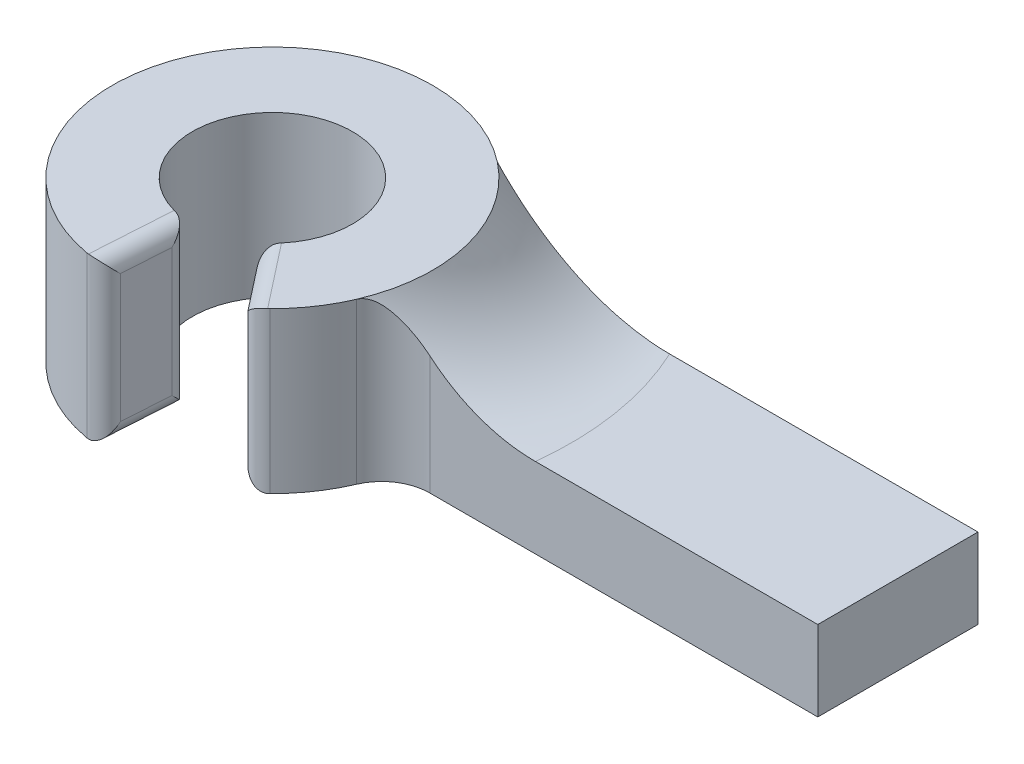
ISO-10303-21;
HEADER;
FILE_DESCRIPTION(('STEP AP214'),'2;1');
FILE_NAME('part.step','',(''),(''),'','','');
FILE_SCHEMA(('AUTOMOTIVE_DESIGN { 1 0 10303 214 1 1 1 1 }'));
ENDSEC;
DATA;
#1=APPLICATION_CONTEXT('core data for automotive mechanical design processes');
#2=APPLICATION_PROTOCOL_DEFINITION('international standard','automotive_design',2000,#1);
#3=PRODUCT_CONTEXT('',#1,'mechanical');
#4=PRODUCT('Part','Part','',(#3));
#5=PRODUCT_RELATED_PRODUCT_CATEGORY('part','',(#4));
#6=PRODUCT_DEFINITION_FORMATION('','',#4);
#7=PRODUCT_DEFINITION_CONTEXT('part definition',#1,'design');
#8=PRODUCT_DEFINITION('design','',#6,#7);
#9=PRODUCT_DEFINITION_SHAPE('','',#8);
#10=(LENGTH_UNIT() NAMED_UNIT(*) SI_UNIT(.MILLI.,.METRE.));
#11=(NAMED_UNIT(*) PLANE_ANGLE_UNIT() SI_UNIT($,.RADIAN.));
#12=(NAMED_UNIT(*) SI_UNIT($,.STERADIAN.) SOLID_ANGLE_UNIT());
#13=UNCERTAINTY_MEASURE_WITH_UNIT(LENGTH_MEASURE(1.E-05),#10,'distance_accuracy_value','');
#14=(GEOMETRIC_REPRESENTATION_CONTEXT(3) GLOBAL_UNCERTAINTY_ASSIGNED_CONTEXT((#13)) GLOBAL_UNIT_ASSIGNED_CONTEXT((#10,
#11,#12)) REPRESENTATION_CONTEXT('',''));
#15=CARTESIAN_POINT('',(0.,0.,0.));
#16=DIRECTION('',(0.,0.,1.));
#17=DIRECTION('',(1.,0.,0.));
#18=AXIS2_PLACEMENT_3D('',#15,#16,#17);
#19=CARTESIAN_POINT('',(0.,10.,0.));
#20=DIRECTION('',(0.,-1.,0.));
#21=DIRECTION('',(0.,0.,-1.));
#22=AXIS2_PLACEMENT_3D('',#19,#20,#21);
#23=CYLINDRICAL_SURFACE('',#22,10.);
#24=CARTESIAN_POINT('',(0.,0.,0.));
#25=DIRECTION('',(0.,1.,0.));
#26=DIRECTION('',(0.,0.,1.));
#27=AXIS2_PLACEMENT_3D('',#24,#25,#26);
#28=CIRCLE('',#27,10.);
#29=CARTESIAN_POINT('',(6.16474964365289,0.,-7.87374509563788));
#30=VERTEX_POINT('',#29);
#31=CARTESIAN_POINT('',(-1.73311878005473,0.,9.84866992513312));
#32=VERTEX_POINT('',#31);
#33=EDGE_CURVE('E204',#30,#32,#28,.T.);
#34=ORIENTED_EDGE('',*,*,#33,.T.);
#35=DIRECTION('',(0.,-1.,0.));
#36=VECTOR('',#35,1.);
#37=CARTESIAN_POINT('',(-1.73311878005473,10.,9.84866992513312));
#38=LINE('',#37,#36);
#39=CARTESIAN_POINT('',(-1.73311878005473,10.,9.84866992513312));
#40=VERTEX_POINT('',#39);
#41=EDGE_CURVE('E11',#32,#40,#38,.F.);
#42=ORIENTED_EDGE('',*,*,#41,.T.);
#43=CARTESIAN_POINT('',(0.,10.,0.));
#44=DIRECTION('',(0.,1.,0.));
#45=DIRECTION('',(0.,0.,1.));
#46=AXIS2_PLACEMENT_3D('',#43,#44,#45);
#47=CIRCLE('',#46,10.);
#48=CARTESIAN_POINT('',(6.16474964365289,10.,-7.87374509563788));
#49=VERTEX_POINT('',#48);
#50=EDGE_CURVE('E197',#49,#40,#47,.T.);
#51=ORIENTED_EDGE('',*,*,#50,.F.);
#52=DIRECTION('',(0.,-1.,0.));
#53=VECTOR('',#52,1.);
#54=CARTESIAN_POINT('',(6.16474964365289,5.,-7.87374509563788));
#55=LINE('',#54,#53);
#56=EDGE_CURVE('E172',#49,#30,#55,.T.);
#57=ORIENTED_EDGE('',*,*,#56,.T.);
#58=EDGE_LOOP('',(#34,#42,#51,#57));
#59=FACE_BOUND('',#58,.T.);
#60=ADVANCED_FACE('F35',(#59),#23,.T.);
#61=CARTESIAN_POINT('',(0.,5.,2.12625490436212));
#62=DIRECTION('',(0.,0.,-1.));
#63=DIRECTION('',(-1.,0.,0.));
#64=AXIS2_PLACEMENT_3D('',#61,#62,#63);
#65=PLANE('',#64);
#66=CARTESIAN_POINT('',(18.5387195037458,5.,2.12625490436212));
#67=CARTESIAN_POINT('',(18.2522167080133,4.99996901371586,2.12625490436212));
#68=CARTESIAN_POINT('',(17.9657224089204,5.01215133792323,2.12625490436212));
#69=CARTESIAN_POINT('',(17.3948102929755,5.0606727920949,2.12625490436212));
#70=CARTESIAN_POINT('',(17.1103922996162,5.0970098439043,2.12625490436212));
#71=CARTESIAN_POINT('',(16.5461330199413,5.19348712011368,2.12625490436212));
#72=CARTESIAN_POINT('',(16.2662846389367,5.25358586818904,2.12625490436212));
#73=CARTESIAN_POINT('',(15.7126361320152,5.39710950841939,2.12625490436212));
#74=CARTESIAN_POINT('',(15.4388360042455,5.48053439342876,2.12625490436212));
#75=CARTESIAN_POINT('',(14.8991153732999,5.67011943541582,2.12625490436212));
#76=CARTESIAN_POINT('',(14.6331976936046,5.77628762961286,2.12625490436212));
#77=CARTESIAN_POINT('',(14.1110925760163,6.01061431386323,2.12625490436212));
#78=CARTESIAN_POINT('',(13.854909549509,6.13878263177138,2.12625490436212));
#79=CARTESIAN_POINT('',(13.3541542404636,6.41617880239697,2.12625490436212));
#80=CARTESIAN_POINT('',(13.1095838799614,6.56541012516974,2.12625490436212));
#81=CARTESIAN_POINT('',(12.6339260264047,6.88378704005655,2.12625490436212));
#82=CARTESIAN_POINT('',(12.4028328402101,7.05292413093678,2.12625490436212));
#83=CARTESIAN_POINT('',(11.9392737330681,7.42306713170316,2.12625490436212));
#84=CARTESIAN_POINT('',(11.707944515475,7.62549932854296,2.12625490436212));
#85=CARTESIAN_POINT('',(11.2644719178751,8.05040918843556,2.12625490436212));
#86=CARTESIAN_POINT('',(11.0523297602989,8.27288812689028,2.12625490436212));
#87=CARTESIAN_POINT('',(10.6485893343611,8.73666868927182,2.12625490436212));
#88=CARTESIAN_POINT('',(10.4570390247242,8.97801208551451,2.12625490436212));
#89=CARTESIAN_POINT('',(10.0966959447661,9.47715366776717,2.12625490436212));
#90=CARTESIAN_POINT('',(9.92790495144122,9.73495313631765,2.12625490436212));
#91=CARTESIAN_POINT('',(9.77133768128377,10.,2.12625490436212));
#92=B_SPLINE_CURVE_WITH_KNOTS('',3,(#66,#67,#68,#69,#70,#71,#72,#73,#74,#75,#76,#77,#78,#79,#80,
#81,#82,#83,#84,#85,#86,#87,#88,#89,#90,#91),.UNSPECIFIED.,.F.,.F.,(4,2,2,2,2,2,2,2,2,2,2,2,4),
(0.,0.859237342830815,1.71840077063951,2.5760710927116,3.43374115204932,4.29171480342366,
5.15007272944756,6.00857223231336,6.86670641391903,7.78762784968396,8.70860791719146,
9.63168849817003,10.5548411095283),.UNSPECIFIED.);
#93=CARTESIAN_POINT('',(18.5387195037458,5.,2.12625490436212));
#94=VERTEX_POINT('',#93);
#95=CARTESIAN_POINT('',(11.9466108438958,7.42289055145649,2.12625490436212));
#96=VERTEX_POINT('',#95);
#97=EDGE_CURVE('E222',#94,#96,#92,.T.);
#98=ORIENTED_EDGE('',*,*,#97,.T.);
#99=DIRECTION('',(0.,1.,0.));
#100=VECTOR('',#99,1.);
#101=CARTESIAN_POINT('',(11.9466108438964,0.,2.12625490436212));
#102=LINE('',#101,#100);
#103=CARTESIAN_POINT('',(11.9466108438964,0.,2.12625490436212));
#104=VERTEX_POINT('',#103);
#105=EDGE_CURVE('E251',#96,#104,#102,.F.);
#106=ORIENTED_EDGE('',*,*,#105,.T.);
#107=DIRECTION('',(1.,0.,0.));
#108=VECTOR('',#107,1.);
#109=CARTESIAN_POINT('',(0.,0.,2.12625490436212));
#110=LINE('',#109,#108);
#111=CARTESIAN_POINT('',(36.1647496436529,0.,2.12625490436212));
#112=VERTEX_POINT('',#111);
#113=EDGE_CURVE('E200',#104,#112,#110,.T.);
#114=ORIENTED_EDGE('',*,*,#113,.T.);
#115=DIRECTION('',(0.,-1.,0.));
#116=VECTOR('',#115,1.);
#117=CARTESIAN_POINT('',(36.1647496436529,5.,2.12625490436212));
#118=LINE('',#117,#116);
#119=CARTESIAN_POINT('',(36.1647496436529,5.,2.12625490436212));
#120=VERTEX_POINT('',#119);
#121=EDGE_CURVE('E182',#120,#112,#118,.T.);
#122=ORIENTED_EDGE('',*,*,#121,.F.);
#123=DIRECTION('',(1.,0.,0.));
#124=VECTOR('',#123,1.);
#125=CARTESIAN_POINT('',(0.,5.,2.12625490436212));
#126=LINE('',#125,#124);
#127=EDGE_CURVE('E173',#94,#120,#126,.T.);
#128=ORIENTED_EDGE('',*,*,#127,.F.);
#129=EDGE_LOOP('',(#98,#106,#114,#122,#128));
#130=FACE_BOUND('',#129,.T.);
#131=ADVANCED_FACE('F235',(#130),#65,.F.);
#132=CARTESIAN_POINT('',(0.,5.,-7.87374509563788));
#133=DIRECTION('',(0.,0.,-1.));
#134=DIRECTION('',(-1.,0.,0.));
#135=AXIS2_PLACEMENT_3D('',#132,#133,#134);
#136=PLANE('',#135);
#137=DIRECTION('',(1.,0.,0.));
#138=VECTOR('',#137,1.);
#139=CARTESIAN_POINT('',(0.,0.,-7.87374509563788));
#140=LINE('',#139,#138);
#141=CARTESIAN_POINT('',(36.1647496436529,0.,-7.87374509563788));
#142=VERTEX_POINT('',#141);
#143=EDGE_CURVE('E207',#30,#142,#140,.T.);
#144=ORIENTED_EDGE('',*,*,#143,.F.);
#145=ORIENTED_EDGE('',*,*,#56,.F.);
#146=CARTESIAN_POINT('',(6.16474964365289,10.,-7.87374509563788));
#147=CARTESIAN_POINT('',(6.32645829788877,9.82739728530957,-7.87374509563788));
#148=CARTESIAN_POINT('',(6.49193659015744,9.65834860594759,-7.87374509563788));
#149=CARTESIAN_POINT('',(6.82993145216811,9.32745083300392,-7.87374509563788));
#150=CARTESIAN_POINT('',(7.00244774597904,9.1656014576862,-7.87374509563788));
#151=CARTESIAN_POINT('',(7.35418387290166,8.84904211119307,-7.87374509563788));
#152=CARTESIAN_POINT('',(7.5334094285243,8.69433849815524,-7.87374509563788));
#153=CARTESIAN_POINT('',(7.89808385064642,8.39246724769461,-7.87374509563788));
#154=CARTESIAN_POINT('',(8.0835328294846,8.24529974642707,-7.87374509563788));
#155=CARTESIAN_POINT('',(8.65194786162231,7.81315947347268,-7.87374509563788));
#156=CARTESIAN_POINT('',(9.04411695838884,7.54013018178168,-7.87374509563788));
#157=CARTESIAN_POINT('',(9.85057525234718,7.02930858348159,-7.87374509563788));
#158=CARTESIAN_POINT('',(10.2648553336953,6.7915019057499,-7.87374509563788));
#159=CARTESIAN_POINT('',(11.0367316227272,6.39442084424156,-7.87374509563788));
#160=CARTESIAN_POINT('',(11.3910268309604,6.22872197582131,-7.87374509563788));
#161=CARTESIAN_POINT('',(12.1116629120164,5.925792814442,-7.87374509563788));
#162=CARTESIAN_POINT('',(12.478004320088,5.78856378846928,-7.87374509563788));
#163=CARTESIAN_POINT('',(13.2189871395495,5.54552362588289,-7.87374509563788));
#164=CARTESIAN_POINT('',(13.5935784785812,5.43956030529373,-7.87374509563788));
#165=CARTESIAN_POINT('',(14.3503827363507,5.26039714268273,-7.87374509563788));
#166=CARTESIAN_POINT('',(14.7325916078486,5.18718036270832,-7.87374509563788));
#167=CARTESIAN_POINT('',(15.4151201744737,5.08809512291513,-7.87374509563788));
#168=CARTESIAN_POINT('',(15.714440217757,5.05526793451425,-7.87374509563788));
#169=CARTESIAN_POINT('',(16.3150512748442,5.01119718723425,-7.87374509563788));
#170=CARTESIAN_POINT('',(16.6163443575678,4.99998197041039,-7.87374509563788));
#171=CARTESIAN_POINT('',(16.9177190816554,5.,-7.87374509563788));
#172=B_SPLINE_CURVE_WITH_KNOTS('',3,(#146,#147,#148,#149,#150,#151,#152,#153,#154,#155,#156,
#157,#158,#159,#160,#161,#162,#163,#164,#165,#166,#167,#168,#169,#170,#171),.UNSPECIFIED.,.F.,
.F.,(4,2,2,2,2,2,2,2,2,2,2,2,4),(0.,0.709476005049628,1.41892422114653,2.12899198508927,
2.83907257333342,4.27076718720008,5.70187603890607,6.87412992780876,8.04643597405069,
9.21293801814834,10.3788359962629,11.2814348383593,12.185216550026),.UNSPECIFIED.);
#173=CARTESIAN_POINT('',(16.9177190816554,5.,-7.87374509563788));
#174=VERTEX_POINT('',#173);
#175=EDGE_CURVE('E169',#49,#174,#172,.T.);
#176=ORIENTED_EDGE('',*,*,#175,.T.);
#177=DIRECTION('',(1.,0.,0.));
#178=VECTOR('',#177,1.);
#179=CARTESIAN_POINT('',(0.,5.,-7.87374509563788));
#180=LINE('',#179,#178);
#181=CARTESIAN_POINT('',(36.1647496436529,5.,-7.87374509563788));
#182=VERTEX_POINT('',#181);
#183=EDGE_CURVE('E162',#174,#182,#180,.T.);
#184=ORIENTED_EDGE('',*,*,#183,.T.);
#185=DIRECTION('',(0.,1.,0.));
#186=VECTOR('',#185,1.);
#187=CARTESIAN_POINT('',(36.1647496436529,5.,-7.87374509563788));
#188=LINE('',#187,#186);
#189=EDGE_CURVE('E167',#142,#182,#188,.T.);
#190=ORIENTED_EDGE('',*,*,#189,.F.);
#191=EDGE_LOOP('',(#144,#145,#176,#184,#190));
#192=FACE_BOUND('',#191,.T.);
#193=ADVANCED_FACE('F165',(#192),#136,.T.);
#194=CARTESIAN_POINT('',(0.,5.,0.));
#195=DIRECTION('',(0.,1.,0.));
#196=DIRECTION('',(0.,0.,1.));
#197=AXIS2_PLACEMENT_3D('',#194,#195,#196);
#198=PLANE('',#197);
#199=ORIENTED_EDGE('',*,*,#183,.F.);
#200=CARTESIAN_POINT('',(0.,5.,0.));
#201=DIRECTION('',(0.,1.,0.));
#202=DIRECTION('',(0.,0.,1.));
#203=AXIS2_PLACEMENT_3D('',#200,#201,#202);
#204=CIRCLE('',#203,18.6602540378444);
#205=EDGE_CURVE('E213',#174,#94,#204,.F.);
#206=ORIENTED_EDGE('',*,*,#205,.T.);
#207=ORIENTED_EDGE('',*,*,#127,.T.);
#208=DIRECTION('',(0.,0.,1.));
#209=VECTOR('',#208,1.);
#210=CARTESIAN_POINT('',(36.1647496436529,5.,-7.87374509563788));
#211=LINE('',#210,#209);
#212=EDGE_CURVE('E176',#182,#120,#211,.T.);
#213=ORIENTED_EDGE('',*,*,#212,.F.);
#214=EDGE_LOOP('',(#199,#206,#207,#213));
#215=FACE_BOUND('',#214,.T.);
#216=ADVANCED_FACE('F177',(#215),#198,.T.);
#217=CARTESIAN_POINT('',(0.,0.,0.));
#218=DIRECTION('',(0.,1.,0.));
#219=DIRECTION('',(0.,0.,1.));
#220=AXIS2_PLACEMENT_3D('',#217,#218,#219);
#221=PLANE('',#220);
#222=CARTESIAN_POINT('',(6.30129421655398,0.,6.42601674417546));
#223=DIRECTION('',(0.,1.,0.));
#224=DIRECTION('',(0.,0.,1.));
#225=AXIS2_PLACEMENT_3D('',#222,#223,#224);
#226=CIRCLE('',#225,1.);
#227=CARTESIAN_POINT('',(7.00143801839331,0.,7.1400186046394));
#228=VERTEX_POINT('',#227);
#229=CARTESIAN_POINT('',(6.91776918091927,0.,7.21339125373925));
#230=VERTEX_POINT('',#229);
#231=EDGE_CURVE('E432',#228,#230,#226,.F.);
#232=ORIENTED_EDGE('',*,*,#231,.T.);
#233=DIRECTION('',(-0.616474964365289,0.,-0.787374509563788));
#234=VECTOR('',#233,1.);
#235=CARTESIAN_POINT('',(3.86974933139023,0.,3.32039758345365));
#236=LINE('',#235,#234);
#237=CARTESIAN_POINT('',(3.80747271335472,0.,3.24085660544543));
#238=VERTEX_POINT('',#237);
#239=EDGE_CURVE('E433',#230,#238,#236,.T.);
#240=ORIENTED_EDGE('',*,*,#239,.T.);
#241=CARTESIAN_POINT('',(0.,0.,0.));
#242=DIRECTION('',(0.,1.,0.));
#243=DIRECTION('',(0.,0.,1.));
#244=AXIS2_PLACEMENT_3D('',#241,#242,#243);
#245=CIRCLE('',#244,5.);
#246=CARTESIAN_POINT('',(-1.30572587414089,0.,4.82649768896651));
#247=VERTEX_POINT('',#246);
#248=EDGE_CURVE('E203',#238,#247,#245,.T.);
#249=ORIENTED_EDGE('',*,*,#248,.T.);
#250=DIRECTION('',(-0.0628090632889159,0.,0.998025561580849));
#251=VECTOR('',#250,1.);
#252=CARTESIAN_POINT('',(-1.62611619447001,0.,9.91744655251957));
#253=LINE('',#252,#251);
#254=CARTESIAN_POINT('',(-1.62261596533818,0.,9.86182849420066));
#255=VERTEX_POINT('',#254);
#256=EDGE_CURVE('E428',#247,#255,#253,.T.);
#257=ORIENTED_EDGE('',*,*,#256,.T.);
#258=CARTESIAN_POINT('',(-1.55980690204926,0.,8.86380293261981));
#259=DIRECTION('',(0.,1.,0.));
#260=DIRECTION('',(0.,0.,1.));
#261=AXIS2_PLACEMENT_3D('',#258,#259,#260);
#262=CIRCLE('',#261,1.);
#263=EDGE_CURVE('E271',#255,#32,#262,.F.);
#264=ORIENTED_EDGE('',*,*,#263,.T.);
#265=ORIENTED_EDGE('',*,*,#33,.F.);
#266=ORIENTED_EDGE('',*,*,#143,.T.);
#267=DIRECTION('',(0.,0.,-1.));
#268=VECTOR('',#267,1.);
#269=CARTESIAN_POINT('',(36.1647496436529,0.,-7.87374509563788));
#270=LINE('',#269,#268);
#271=EDGE_CURVE('E187',#112,#142,#270,.T.);
#272=ORIENTED_EDGE('',*,*,#271,.F.);
#273=ORIENTED_EDGE('',*,*,#113,.F.);
#274=CARTESIAN_POINT('',(11.9466108438964,0.,5.12625490436212));
#275=DIRECTION('',(0.,1.,0.));
#276=DIRECTION('',(0.,0.,1.));
#277=AXIS2_PLACEMENT_3D('',#274,#275,#276);
#278=CIRCLE('',#277,3.);
#279=CARTESIAN_POINT('',(9.18970064915109,0.,3.94327300335548));
#280=VERTEX_POINT('',#279);
#281=EDGE_CURVE('E260',#104,#280,#278,.T.);
#282=ORIENTED_EDGE('',*,*,#281,.T.);
#283=EDGE_CURVE('E201',#228,#280,#28,.T.);
#284=ORIENTED_EDGE('',*,*,#283,.F.);
#285=EDGE_LOOP('',(#232,#240,#249,#257,#264,#265,#266,#272,#273,#282,#284));
#286=FACE_BOUND('',#285,.T.);
#287=ADVANCED_FACE('F236',(#286),#221,.F.);
#288=CARTESIAN_POINT('',(7.00143801839331,10.,7.1400186046394));
#289=VERTEX_POINT('',#288);
#290=CARTESIAN_POINT('',(9.18970064915109,10.,3.94327300335548));
#291=VERTEX_POINT('',#290);
#292=EDGE_CURVE('E193',#289,#291,#47,.T.);
#293=ORIENTED_EDGE('',*,*,#292,.F.);
#294=DIRECTION('',(0.,-1.,0.));
#295=VECTOR('',#294,1.);
#296=CARTESIAN_POINT('',(7.00143801839331,10.,7.14001860463941));
#297=LINE('',#296,#295);
#298=EDGE_CURVE('E45',#289,#228,#297,.T.);
#299=ORIENTED_EDGE('',*,*,#298,.T.);
#300=ORIENTED_EDGE('',*,*,#283,.T.);
#301=DIRECTION('',(0.,-1.,0.));
#302=VECTOR('',#301,1.);
#303=CARTESIAN_POINT('',(9.18970064915109,10.,3.94327300335548));
#304=LINE('',#303,#302);
#305=EDGE_CURVE('E261',#280,#291,#304,.F.);
#306=ORIENTED_EDGE('',*,*,#305,.T.);
#307=EDGE_LOOP('',(#293,#299,#300,#306));
#308=FACE_BOUND('',#307,.T.);
#309=ADVANCED_FACE('F246',(#308),#23,.T.);
#310=CARTESIAN_POINT('',(0.,10.,0.));
#311=DIRECTION('',(-0.787374509563788,0.,0.616474964365289));
#312=DIRECTION('',(0.616474964365289,0.,0.787374509563788));
#313=AXIS2_PLACEMENT_3D('',#310,#311,#312);
#314=PLANE('',#313);
#315=DIRECTION('',(-0.616474964365289,0.,-0.787374509563788));
#316=VECTOR('',#315,1.);
#317=CARTESIAN_POINT('',(6.16474964365289,1.,7.87374509563788));
#318=LINE('',#317,#316);
#319=CARTESIAN_POINT('',(3.64711507346854,1.,4.6581704177583));
#320=VERTEX_POINT('',#319);
#321=CARTESIAN_POINT('',(5.51391970699019,1.,7.04249170854075));
#322=VERTEX_POINT('',#321);
#323=EDGE_CURVE('E387',#320,#322,#318,.F.);
#324=ORIENTED_EDGE('',*,*,#323,.T.);
#325=DIRECTION('',(0.,1.,0.));
#326=VECTOR('',#325,1.);
#327=CARTESIAN_POINT('',(5.51391970699019,10.,7.04249170854075));
#328=LINE('',#327,#326);
#329=CARTESIAN_POINT('',(5.51391970699019,9.,7.04249170854075));
#330=VERTEX_POINT('',#329);
#331=EDGE_CURVE('E385',#322,#330,#328,.T.);
#332=ORIENTED_EDGE('',*,*,#331,.T.);
#333=DIRECTION('',(-0.616474964365289,0.,-0.787374509563788));
#334=VECTOR('',#333,1.);
#335=CARTESIAN_POINT('',(0.,9.,0.));
#336=LINE('',#335,#334);
#337=CARTESIAN_POINT('',(3.64711507346854,9.,4.6581704177583));
#338=VERTEX_POINT('',#337);
#339=EDGE_CURVE('E389',#330,#338,#336,.T.);
#340=ORIENTED_EDGE('',*,*,#339,.T.);
#341=DIRECTION('',(0.,-1.,0.));
#342=VECTOR('',#341,1.);
#343=CARTESIAN_POINT('',(3.64711507346854,10.,4.6581704177583));
#344=LINE('',#343,#342);
#345=EDGE_CURVE('E293',#338,#320,#344,.T.);
#346=ORIENTED_EDGE('',*,*,#345,.T.);
#347=EDGE_LOOP('',(#324,#332,#340,#346));
#348=FACE_BOUND('',#347,.T.);
#349=ADVANCED_FACE('F395',(#348),#314,.T.);
#350=CARTESIAN_POINT('',(0.,10.,0.));
#351=DIRECTION('',(0.998025561580849,0.,0.0628090632889159));
#352=DIRECTION('',(0.0628090632889159,0.,-0.998025561580849));
#353=AXIS2_PLACEMENT_3D('',#350,#351,#352);
#354=PLANE('',#353);
#355=DIRECTION('',(-0.0628090632889159,0.,0.998025561580849));
#356=VECTOR('',#355,1.);
#357=CARTESIAN_POINT('',(0.,9.,0.));
#358=LINE('',#357,#356);
#359=CARTESIAN_POINT('',(-0.37158342951898,9.,5.9043988478851));
#360=VERTEX_POINT('',#359);
#361=CARTESIAN_POINT('',(-0.561781340468411,9.,8.92661199590872));
#362=VERTEX_POINT('',#361);
#363=EDGE_CURVE('E58',#360,#362,#358,.T.);
#364=ORIENTED_EDGE('',*,*,#363,.T.);
#365=DIRECTION('',(0.,1.,0.));
#366=VECTOR('',#365,1.);
#367=CARTESIAN_POINT('',(-0.561781340468411,0.,8.92661199590872));
#368=LINE('',#367,#366);
#369=CARTESIAN_POINT('',(-0.561781340468411,1.,8.92661199590872));
#370=VERTEX_POINT('',#369);
#371=EDGE_CURVE('E53',#362,#370,#368,.F.);
#372=ORIENTED_EDGE('',*,*,#371,.T.);
#373=DIRECTION('',(-0.0628090632889159,0.,0.998025561580849));
#374=VECTOR('',#373,1.);
#375=CARTESIAN_POINT('',(-0.31404531644458,1.,4.99012780790425));
#376=LINE('',#375,#374);
#377=CARTESIAN_POINT('',(-0.37158342951898,1.,5.9043988478851));
#378=VERTEX_POINT('',#377);
#379=EDGE_CURVE('E373',#370,#378,#376,.F.);
#380=ORIENTED_EDGE('',*,*,#379,.T.);
#381=DIRECTION('',(0.,-1.,0.));
#382=VECTOR('',#381,1.);
#383=CARTESIAN_POINT('',(-0.37158342951898,10.,5.9043988478851));
#384=LINE('',#383,#382);
#385=EDGE_CURVE('E350',#378,#360,#384,.F.);
#386=ORIENTED_EDGE('',*,*,#385,.T.);
#387=EDGE_LOOP('',(#364,#372,#380,#386));
#388=FACE_BOUND('',#387,.T.);
#389=ADVANCED_FACE('F308',(#388),#354,.T.);
#390=CARTESIAN_POINT('',(0.,10.,0.));
#391=DIRECTION('',(0.,-1.,0.));
#392=DIRECTION('',(0.,0.,-1.));
#393=AXIS2_PLACEMENT_3D('',#390,#391,#392);
#394=CYLINDRICAL_SURFACE('',#393,5.);
#395=ORIENTED_EDGE('',*,*,#248,.F.);
#396=CARTESIAN_POINT('',(3.807472713354,0.,3.24085660544482));
#397=CARTESIAN_POINT('',(3.78902745111643,-3.77308436355088E-06,3.26252165037697));
#398=CARTESIAN_POINT('',(3.77046609270641,0.0011598989415206,3.28395608443061));
#399=CARTESIAN_POINT('',(3.73311118354183,0.00582213321373394,3.32636373078039));
#400=CARTESIAN_POINT('',(3.71431763278728,0.00932069546001272,3.34733694307654));
#401=CARTESIAN_POINT('',(3.69540798586028,0.0139867028164888,3.36807954449418));
#402=B_SPLINE_CURVE_WITH_KNOTS('',3,(#396,#397,#398,#399,#400,#401),.UNSPECIFIED.,.F.,.F.,(4,2,
4),(0.,0.0851341182856827,0.170268236569527),.UNSPECIFIED.);
#403=CARTESIAN_POINT('',(3.69540798586028,0.0139867028166301,3.36807954449418));
#404=VERTEX_POINT('',#403);
#405=EDGE_CURVE('E285',#238,#404,#402,.T.);
#406=ORIENTED_EDGE('',*,*,#405,.T.);
#407=DIRECTION('',(0.,-1.,0.));
#408=VECTOR('',#407,1.);
#409=CARTESIAN_POINT('',(3.69540798586028,10.,3.36807954449418));
#410=LINE('',#409,#408);
#411=CARTESIAN_POINT('',(3.69540798586028,9.98601329718337,3.36807954449418));
#412=VERTEX_POINT('',#411);
#413=EDGE_CURVE('E328',#404,#412,#410,.F.);
#414=ORIENTED_EDGE('',*,*,#413,.T.);
#415=CARTESIAN_POINT('',(3.69540798586028,9.98601329718337,3.36807954449418));
#416=CARTESIAN_POINT('',(3.71431763278714,9.99067930453991,3.34733694307646));
#417=CARTESIAN_POINT('',(3.73311118354167,9.99417786678623,3.32636373078033));
#418=CARTESIAN_POINT('',(3.77046609270644,9.9988401010585,3.28395608443081));
#419=CARTESIAN_POINT('',(3.78902745111669,10.0000037730844,3.26252165037741));
#420=CARTESIAN_POINT('',(3.8074727133546,10.,3.24085660544559));
#421=B_SPLINE_CURVE_WITH_KNOTS('',3,(#415,#416,#417,#418,#419,#420),.UNSPECIFIED.,.F.,.F.,(4,2,
4),(0.,0.0851341182837666,0.170268236569358),.UNSPECIFIED.);
#422=CARTESIAN_POINT('',(3.80747271335459,10.,3.24085660544558));
#423=VERTEX_POINT('',#422);
#424=EDGE_CURVE('E294',#412,#423,#421,.T.);
#425=ORIENTED_EDGE('',*,*,#424,.T.);
#426=CARTESIAN_POINT('',(0.,10.,0.));
#427=DIRECTION('',(0.,1.,0.));
#428=DIRECTION('',(0.,0.,1.));
#429=AXIS2_PLACEMENT_3D('',#426,#427,#428);
#430=CIRCLE('',#429,5.);
#431=CARTESIAN_POINT('',(-1.30572587414089,10.,4.82649768896651));
#432=VERTEX_POINT('',#431);
#433=EDGE_CURVE('E195',#423,#432,#430,.T.);
#434=ORIENTED_EDGE('',*,*,#433,.T.);
#435=CARTESIAN_POINT('',(-1.30572587414089,10.,4.82649768896651));
#436=CARTESIAN_POINT('',(-1.27825885711062,10.0000037730844,4.83392499307916));
#437=CARTESIAN_POINT('',(-1.25082659457665,9.99884010105847,4.84109646165194));
#438=CARTESIAN_POINT('',(-1.19603157850186,9.99417786678626,4.85492772771759));
#439=CARTESIAN_POINT('',(-1.16866882496105,9.99067930453998,4.86158752521047));
#440=CARTESIAN_POINT('',(-1.14134082591652,9.98601329718351,4.86799148716349));
#441=B_SPLINE_CURVE_WITH_KNOTS('',3,(#435,#436,#437,#438,#439,#440),.UNSPECIFIED.,.F.,.F.,(4,2,
4),(0.,0.085134118285586,0.170268236569342),.UNSPECIFIED.);
#442=CARTESIAN_POINT('',(-1.14134082591652,9.98601329718337,4.86799148716349));
#443=VERTEX_POINT('',#442);
#444=EDGE_CURVE('E314',#432,#443,#441,.T.);
#445=ORIENTED_EDGE('',*,*,#444,.T.);
#446=DIRECTION('',(0.,-1.,0.));
#447=VECTOR('',#446,1.);
#448=CARTESIAN_POINT('',(-1.14134082591652,10.,4.86799148716349));
#449=LINE('',#448,#447);
#450=CARTESIAN_POINT('',(-1.14134082591652,0.0139867028166301,4.86799148716349));
#451=VERTEX_POINT('',#450);
#452=EDGE_CURVE('E351',#443,#451,#449,.T.);
#453=ORIENTED_EDGE('',*,*,#452,.T.);
#454=CARTESIAN_POINT('',(-1.14134082591652,0.0139867028166295,4.86799148716349));
#455=CARTESIAN_POINT('',(-1.16866882496104,0.00932069546009034,4.86158752521047));
#456=CARTESIAN_POINT('',(-1.19603157850185,0.00582213321376718,4.85492772771759));
#457=CARTESIAN_POINT('',(-1.25082659457664,0.00115989894150296,4.84109646165194));
#458=CARTESIAN_POINT('',(-1.27825885711062,-3.77308438807185E-06,4.83392499307917));
#459=CARTESIAN_POINT('',(-1.30572587414089,0.,4.82649768896651));
#460=B_SPLINE_CURVE_WITH_KNOTS('',3,(#454,#455,#456,#457,#458,#459),.UNSPECIFIED.,.F.,.F.,(4,2,
4),(0.,0.0851341182837667,0.170268236569357),.UNSPECIFIED.);
#461=EDGE_CURVE('E322',#451,#247,#460,.T.);
#462=ORIENTED_EDGE('',*,*,#461,.T.);
#463=EDGE_LOOP('',(#395,#406,#414,#425,#434,#445,#453,#462));
#464=FACE_BOUND('',#463,.T.);
#465=ADVANCED_FACE('F302',(#464),#394,.F.);
#466=CARTESIAN_POINT('',(0.,10.,0.));
#467=DIRECTION('',(0.,1.,0.));
#468=DIRECTION('',(0.,0.,1.));
#469=AXIS2_PLACEMENT_3D('',#466,#467,#468);
#470=PLANE('',#469);
#471=ORIENTED_EDGE('',*,*,#433,.F.);
#472=DIRECTION('',(-0.616474964365289,0.,-0.787374509563788));
#473=VECTOR('',#472,1.);
#474=CARTESIAN_POINT('',(0.78737450956379,10.,-0.61647496436529));
#475=LINE('',#474,#473);
#476=CARTESIAN_POINT('',(6.91776918091927,10.,7.21339125373925));
#477=VERTEX_POINT('',#476);
#478=EDGE_CURVE('E377',#423,#477,#475,.F.);
#479=ORIENTED_EDGE('',*,*,#478,.T.);
#480=CARTESIAN_POINT('',(6.30129421655398,10.,6.42601674417546));
#481=DIRECTION('',(0.,1.,0.));
#482=DIRECTION('',(0.,0.,1.));
#483=AXIS2_PLACEMENT_3D('',#480,#481,#482);
#484=CIRCLE('',#483,1.);
#485=EDGE_CURVE('E379',#477,#289,#484,.T.);
#486=ORIENTED_EDGE('',*,*,#485,.T.);
#487=ORIENTED_EDGE('',*,*,#292,.T.);
#488=EDGE_CURVE('E196',#291,#49,#47,.T.);
#489=ORIENTED_EDGE('',*,*,#488,.T.);
#490=ORIENTED_EDGE('',*,*,#50,.T.);
#491=CARTESIAN_POINT('',(-1.55980690204926,10.,8.86380293261981));
#492=DIRECTION('',(0.,1.,0.));
#493=DIRECTION('',(0.,0.,1.));
#494=AXIS2_PLACEMENT_3D('',#491,#492,#493);
#495=CIRCLE('',#494,1.);
#496=CARTESIAN_POINT('',(-1.62261596533818,10.,9.86182849420066));
#497=VERTEX_POINT('',#496);
#498=EDGE_CURVE('E383',#40,#497,#495,.T.);
#499=ORIENTED_EDGE('',*,*,#498,.T.);
#500=DIRECTION('',(-0.0628090632889159,0.,0.998025561580849));
#501=VECTOR('',#500,1.);
#502=CARTESIAN_POINT('',(-0.99802556158085,10.,-0.0628090632889159));
#503=LINE('',#502,#501);
#504=EDGE_CURVE('E381',#497,#432,#503,.F.);
#505=ORIENTED_EDGE('',*,*,#504,.T.);
#506=EDGE_LOOP('',(#471,#479,#486,#487,#489,#490,#499,#505));
#507=FACE_BOUND('',#506,.T.);
#508=ADVANCED_FACE('F307',(#507),#470,.T.);
#509=CARTESIAN_POINT('',(0.,15.,0.));
#510=DIRECTION('',(0.,1.,0.));
#511=DIRECTION('',(0.,0.,1.));
#512=AXIS2_PLACEMENT_3D('',#509,#510,#511);
#513=TOROIDAL_SURFACE('',#512,18.6602540378444,10.);
#514=ORIENTED_EDGE('',*,*,#97,.F.);
#515=ORIENTED_EDGE('',*,*,#205,.F.);
#516=ORIENTED_EDGE('',*,*,#175,.F.);
#517=ORIENTED_EDGE('',*,*,#488,.F.);
#518=CARTESIAN_POINT('',(9.18970064915109,10.,3.94327300335548));
#519=CARTESIAN_POINT('',(9.20546558024916,10.0000195366924,3.90651719918485));
#520=CARTESIAN_POINT('',(9.2219667208401,9.99819778621338,3.87010708736136));
#521=CARTESIAN_POINT('',(9.25623052092531,9.99105261758267,3.79831481970713));
#522=CARTESIAN_POINT('',(9.27399085645889,9.98573550770575,3.76293093168532));
#523=CARTESIAN_POINT('',(9.32828804615356,9.96504768707457,3.65985258986357));
#524=CARTESIAN_POINT('',(9.36641028096951,9.94492661162829,3.59391740682986));
#525=CARTESIAN_POINT('',(9.45908556204816,9.88579863978619,3.44629819296004));
#526=CARTESIAN_POINT('',(9.51476584146497,9.8426690775339,3.36704048025726));
#527=CARTESIAN_POINT('',(9.62946468816002,9.74409106739734,3.21844272559907));
#528=CARTESIAN_POINT('',(9.6885074513288,9.68854178298052,3.14919197382295));
#529=CARTESIAN_POINT('',(9.8057073724127,9.57281394051317,3.02302873378914));
#530=CARTESIAN_POINT('',(9.86376224808534,9.51300359719099,2.96567359152351));
#531=CARTESIAN_POINT('',(9.98162613423356,9.38892440535874,2.85794859911021));
#532=CARTESIAN_POINT('',(10.0414366334456,9.32465170588363,2.80758489778858));
#533=CARTESIAN_POINT('',(10.1628878310982,9.19315484184868,2.71290237403355));
#534=CARTESIAN_POINT('',(10.2245321126892,9.12592475671714,2.66859648180411));
#535=CARTESIAN_POINT('',(10.3495838977373,8.98973130984078,2.58555984733016));
#536=CARTESIAN_POINT('',(10.4129912220246,8.92076812429088,2.54682854101943));
#537=CARTESIAN_POINT('',(10.5890713156343,8.73072141984693,2.44790805558042));
#538=CARTESIAN_POINT('',(10.7036391340508,8.60865327385385,2.3929200475224));
#539=CARTESIAN_POINT('',(10.9387447614641,8.36444641155854,2.29777987432893));
#540=CARTESIAN_POINT('',(11.0592848547562,8.24230768619159,2.2576334363042));
#541=CARTESIAN_POINT('',(11.3046112669181,8.00173154318065,2.19305191074155));
#542=CARTESIAN_POINT('',(11.4293113203795,7.88326615045893,2.16839866966916));
#543=CARTESIAN_POINT('',(11.6203890724835,7.70831669642513,2.14335320782611));
#544=CARTESIAN_POINT('',(11.6847619476806,7.65045064862634,2.13699373435957));
#545=CARTESIAN_POINT('',(11.8147681536515,7.53580594110763,2.12844609523356));
#546=CARTESIAN_POINT('',(11.8804018018631,7.4790275626231,2.12625899437639));
#547=CARTESIAN_POINT('',(11.9466108438961,7.42289055145622,2.12625490436211));
#548=B_SPLINE_CURVE_WITH_KNOTS('',3,(#518,#519,#520,#521,#522,#523,#524,#525,#526,#527,#528,
#529,#530,#531,#532,#533,#534,#535,#536,#537,#538,#539,#540,#541,#542,#543,#544,#545,#546,#547),
.UNSPECIFIED.,.F.,.F.,(4,2,2,2,2,2,2,2,2,2,2,2,2,2,4),(0.,0.119884075935319,0.239552382047124,
0.474662694763876,0.790978739356068,1.10996278335885,1.41306417016202,1.7164304619527,
2.02043449472845,2.32440774510379,2.85222129097588,3.3802382990903,3.90064334214454,
4.16091654031354,4.42125615212129),.UNSPECIFIED.);
#549=EDGE_CURVE('E258',#291,#96,#548,.T.);
#550=ORIENTED_EDGE('',*,*,#549,.T.);
#551=EDGE_LOOP('',(#514,#515,#516,#517,#550));
#552=FACE_BOUND('',#551,.T.);
#553=ADVANCED_FACE('F229',(#552),#513,.F.);
#554=CARTESIAN_POINT('',(11.9466108438964,10.,5.12625490436212));
#555=DIRECTION('',(0.,-1.,0.));
#556=DIRECTION('',(0.,0.,-1.));
#557=AXIS2_PLACEMENT_3D('',#554,#555,#556);
#558=CYLINDRICAL_SURFACE('',#557,3.);
#559=ORIENTED_EDGE('',*,*,#549,.F.);
#560=ORIENTED_EDGE('',*,*,#305,.F.);
#561=ORIENTED_EDGE('',*,*,#281,.F.);
#562=ORIENTED_EDGE('',*,*,#105,.F.);
#563=EDGE_LOOP('',(#559,#560,#561,#562));
#564=FACE_BOUND('',#563,.T.);
#565=ADVANCED_FACE('F256',(#564),#558,.F.);
#566=CARTESIAN_POINT('',(0.78737450956379,9.,-0.61647496436529));
#567=DIRECTION('',(-0.616474964365289,0.,-0.787374509563788));
#568=DIRECTION('',(-0.787374509563788,0.,0.616474964365289));
#569=AXIS2_PLACEMENT_3D('',#566,#567,#568);
#570=CYLINDRICAL_SURFACE('',#569,1.);
#571=CARTESIAN_POINT('',(4.43448958303233,9.,4.04169545339301));
#572=DIRECTION('',(-0.435913627734431,-0.707106781186547,-0.556757855045987));
#573=DIRECTION('',(0.435913627734431,-0.707106781186547,0.556757855045987));
#574=AXIS2_PLACEMENT_3D('',#571,#572,#573);
#575=ELLIPSE('',#574,1.41421356237309,1.);
#576=EDGE_CURVE('E367',#338,#412,#575,.T.);
#577=ORIENTED_EDGE('',*,*,#576,.F.);
#578=ORIENTED_EDGE('',*,*,#339,.F.);
#579=CARTESIAN_POINT('',(6.30129421655398,9.,6.42601674417546));
#580=DIRECTION('',(0.435913627734431,-0.707106781186547,0.556757855045987));
#581=DIRECTION('',(-0.435913627734431,-0.707106781186547,-0.556757855045987));
#582=AXIS2_PLACEMENT_3D('',#579,#580,#581);
#583=ELLIPSE('',#582,1.41421356237309,1.);
#584=EDGE_CURVE('E364',#477,#330,#583,.T.);
#585=ORIENTED_EDGE('',*,*,#584,.F.);
#586=ORIENTED_EDGE('',*,*,#478,.F.);
#587=ORIENTED_EDGE('',*,*,#424,.F.);
#588=EDGE_LOOP('',(#577,#578,#585,#586,#587));
#589=FACE_BOUND('',#588,.T.);
#590=ADVANCED_FACE('F276',(#589),#570,.T.);
#591=CARTESIAN_POINT('',(6.30129421655398,10.,6.42601674417546));
#592=DIRECTION('',(0.,-1.,0.));
#593=DIRECTION('',(0.,0.,-1.));
#594=AXIS2_PLACEMENT_3D('',#591,#592,#593);
#595=CYLINDRICAL_SURFACE('',#594,1.);
#596=ORIENTED_EDGE('',*,*,#584,.T.);
#597=ORIENTED_EDGE('',*,*,#331,.F.);
#598=CARTESIAN_POINT('',(6.30129421655398,1.,6.42601674417546));
#599=DIRECTION('',(-0.435913627734431,-0.707106781186547,-0.556757855045987));
#600=DIRECTION('',(0.435913627734431,-0.707106781186547,0.556757855045987));
#601=AXIS2_PLACEMENT_3D('',#598,#599,#600);
#602=ELLIPSE('',#601,1.41421356237309,1.);
#603=EDGE_CURVE('E356',#230,#322,#602,.T.);
#604=ORIENTED_EDGE('',*,*,#603,.F.);
#605=ORIENTED_EDGE('',*,*,#231,.F.);
#606=ORIENTED_EDGE('',*,*,#298,.F.);
#607=ORIENTED_EDGE('',*,*,#485,.F.);
#608=EDGE_LOOP('',(#596,#597,#604,#605,#606,#607));
#609=FACE_BOUND('',#608,.T.);
#610=ADVANCED_FACE('F413',(#609),#595,.T.);
#611=CARTESIAN_POINT('',(4.43448958303233,10.,4.04169545339301));
#612=DIRECTION('',(0.,-1.,0.));
#613=DIRECTION('',(0.,0.,-1.));
#614=AXIS2_PLACEMENT_3D('',#611,#612,#613);
#615=CYLINDRICAL_SURFACE('',#614,1.);
#616=ORIENTED_EDGE('',*,*,#576,.T.);
#617=ORIENTED_EDGE('',*,*,#413,.F.);
#618=CARTESIAN_POINT('',(4.43448958303233,1.,4.04169545339301));
#619=DIRECTION('',(0.435913627734431,-0.707106781186547,0.556757855045987));
#620=DIRECTION('',(-0.435913627734431,-0.707106781186547,-0.556757855045987));
#621=AXIS2_PLACEMENT_3D('',#618,#619,#620);
#622=ELLIPSE('',#621,1.41421356237309,1.);
#623=EDGE_CURVE('E353',#320,#404,#622,.T.);
#624=ORIENTED_EDGE('',*,*,#623,.F.);
#625=ORIENTED_EDGE('',*,*,#345,.F.);
#626=EDGE_LOOP('',(#616,#617,#624,#625));
#627=FACE_BOUND('',#626,.T.);
#628=ADVANCED_FACE('F281',(#627),#615,.T.);
#629=CARTESIAN_POINT('',(0.78737450956379,1.,-0.61647496436529));
#630=DIRECTION('',(0.616474964365289,0.,0.787374509563788));
#631=DIRECTION('',(0.787374509563788,0.,-0.616474964365289));
#632=AXIS2_PLACEMENT_3D('',#629,#630,#631);
#633=CYLINDRICAL_SURFACE('',#632,1.);
#634=ORIENTED_EDGE('',*,*,#603,.T.);
#635=ORIENTED_EDGE('',*,*,#323,.F.);
#636=ORIENTED_EDGE('',*,*,#623,.T.);
#637=ORIENTED_EDGE('',*,*,#405,.F.);
#638=ORIENTED_EDGE('',*,*,#239,.F.);
#639=EDGE_LOOP('',(#634,#635,#636,#637,#638));
#640=FACE_BOUND('',#639,.T.);
#641=ADVANCED_FACE('F277',(#640),#633,.T.);
#642=CARTESIAN_POINT('',(-0.99802556158085,9.,-0.0628090632889159));
#643=DIRECTION('',(-0.0628090632889159,0.,0.998025561580849));
#644=DIRECTION('',(0.998025561580849,0.,0.0628090632889159));
#645=AXIS2_PLACEMENT_3D('',#642,#643,#644);
#646=CYLINDRICAL_SURFACE('',#645,1.);
#647=CARTESIAN_POINT('',(-1.55980690204926,9.,8.86380293261981));
#648=DIRECTION('',(-0.0444127145715675,-0.707106781186547,0.705710642391331));
#649=DIRECTION('',(0.0444127145715675,-0.707106781186547,-0.705710642391331));
#650=AXIS2_PLACEMENT_3D('',#647,#648,#649);
#651=ELLIPSE('',#650,1.41421356237309,1.);
#652=EDGE_CURVE('E354',#362,#497,#651,.T.);
#653=ORIENTED_EDGE('',*,*,#652,.F.);
#654=ORIENTED_EDGE('',*,*,#363,.F.);
#655=CARTESIAN_POINT('',(-1.36960899109983,9.,5.84158978459619));
#656=DIRECTION('',(0.0444127145715675,-0.707106781186547,-0.705710642391331));
#657=DIRECTION('',(-0.0444127145715675,-0.707106781186547,0.705710642391331));
#658=AXIS2_PLACEMENT_3D('',#655,#656,#657);
#659=ELLIPSE('',#658,1.41421356237309,1.);
#660=EDGE_CURVE('E40',#443,#360,#659,.T.);
#661=ORIENTED_EDGE('',*,*,#660,.F.);
#662=ORIENTED_EDGE('',*,*,#444,.F.);
#663=ORIENTED_EDGE('',*,*,#504,.F.);
#664=EDGE_LOOP('',(#653,#654,#661,#662,#663));
#665=FACE_BOUND('',#664,.T.);
#666=ADVANCED_FACE('F37',(#665),#646,.T.);
#667=CARTESIAN_POINT('',(-1.36960899109983,10.,5.84158978459619));
#668=DIRECTION('',(0.,-1.,0.));
#669=DIRECTION('',(0.,0.,-1.));
#670=AXIS2_PLACEMENT_3D('',#667,#668,#669);
#671=CYLINDRICAL_SURFACE('',#670,1.);
#672=ORIENTED_EDGE('',*,*,#660,.T.);
#673=ORIENTED_EDGE('',*,*,#385,.F.);
#674=CARTESIAN_POINT('',(-1.36960899109983,1.,5.84158978459619));
#675=DIRECTION('',(-0.0444127145715675,-0.707106781186547,0.705710642391331));
#676=DIRECTION('',(0.0444127145715675,-0.707106781186547,-0.705710642391331));
#677=AXIS2_PLACEMENT_3D('',#674,#675,#676);
#678=ELLIPSE('',#677,1.41421356237309,1.);
#679=EDGE_CURVE('E359',#451,#378,#678,.T.);
#680=ORIENTED_EDGE('',*,*,#679,.F.);
#681=ORIENTED_EDGE('',*,*,#452,.F.);
#682=EDGE_LOOP('',(#672,#673,#680,#681));
#683=FACE_BOUND('',#682,.T.);
#684=ADVANCED_FACE('F337',(#683),#671,.T.);
#685=CARTESIAN_POINT('',(-1.55980690204926,10.,8.86380293261981));
#686=DIRECTION('',(0.,-1.,0.));
#687=DIRECTION('',(0.,0.,-1.));
#688=AXIS2_PLACEMENT_3D('',#685,#686,#687);
#689=CYLINDRICAL_SURFACE('',#688,1.);
#690=ORIENTED_EDGE('',*,*,#41,.F.);
#691=ORIENTED_EDGE('',*,*,#263,.F.);
#692=CARTESIAN_POINT('',(-1.55980690204926,1.,8.86380293261981));
#693=DIRECTION('',(0.0444127145715675,-0.707106781186547,-0.705710642391331));
#694=DIRECTION('',(-0.0444127145715675,-0.707106781186547,0.705710642391331));
#695=AXIS2_PLACEMENT_3D('',#692,#693,#694);
#696=ELLIPSE('',#695,1.41421356237309,1.);
#697=EDGE_CURVE('E192',#370,#255,#696,.T.);
#698=ORIENTED_EDGE('',*,*,#697,.F.);
#699=ORIENTED_EDGE('',*,*,#371,.F.);
#700=ORIENTED_EDGE('',*,*,#652,.T.);
#701=ORIENTED_EDGE('',*,*,#498,.F.);
#702=EDGE_LOOP('',(#690,#691,#698,#699,#700,#701));
#703=FACE_BOUND('',#702,.T.);
#704=ADVANCED_FACE('F333',(#703),#689,.T.);
#705=CARTESIAN_POINT('',(-0.99802556158085,1.,-0.0628090632889159));
#706=DIRECTION('',(0.0628090632889159,0.,-0.998025561580849));
#707=DIRECTION('',(-0.998025561580849,0.,-0.0628090632889159));
#708=AXIS2_PLACEMENT_3D('',#705,#706,#707);
#709=CYLINDRICAL_SURFACE('',#708,1.);
#710=ORIENTED_EDGE('',*,*,#679,.T.);
#711=ORIENTED_EDGE('',*,*,#379,.F.);
#712=ORIENTED_EDGE('',*,*,#697,.T.);
#713=ORIENTED_EDGE('',*,*,#256,.F.);
#714=ORIENTED_EDGE('',*,*,#461,.F.);
#715=EDGE_LOOP('',(#710,#711,#712,#713,#714));
#716=FACE_BOUND('',#715,.T.);
#717=ADVANCED_FACE('F329',(#716),#709,.T.);
#718=CARTESIAN_POINT('',(36.1647496436529,0.,0.));
#719=DIRECTION('',(-1.,0.,0.));
#720=DIRECTION('',(0.,0.,1.));
#721=AXIS2_PLACEMENT_3D('',#718,#719,#720);
#722=PLANE('',#721);
#723=ORIENTED_EDGE('',*,*,#189,.T.);
#724=ORIENTED_EDGE('',*,*,#212,.T.);
#725=ORIENTED_EDGE('',*,*,#121,.T.);
#726=ORIENTED_EDGE('',*,*,#271,.T.);
#727=EDGE_LOOP('',(#723,#724,#725,#726));
#728=FACE_BOUND('',#727,.T.);
#729=ADVANCED_FACE('F185',(#728),#722,.F.);
#730=CLOSED_SHELL('',(#60,#131,#193,#216,#287,#309,#349,#389,#465,#508,#553,#565,#590,#610,#628,
#641,#666,#684,#704,#717,#729));
#731=MANIFOLD_SOLID_BREP('B2',#730);
#732=ADVANCED_BREP_SHAPE_REPRESENTATION('',(#18,#731),#14);
#733=SHAPE_DEFINITION_REPRESENTATION(#9,#732);
ENDSEC;
END-ISO-10303-21;
